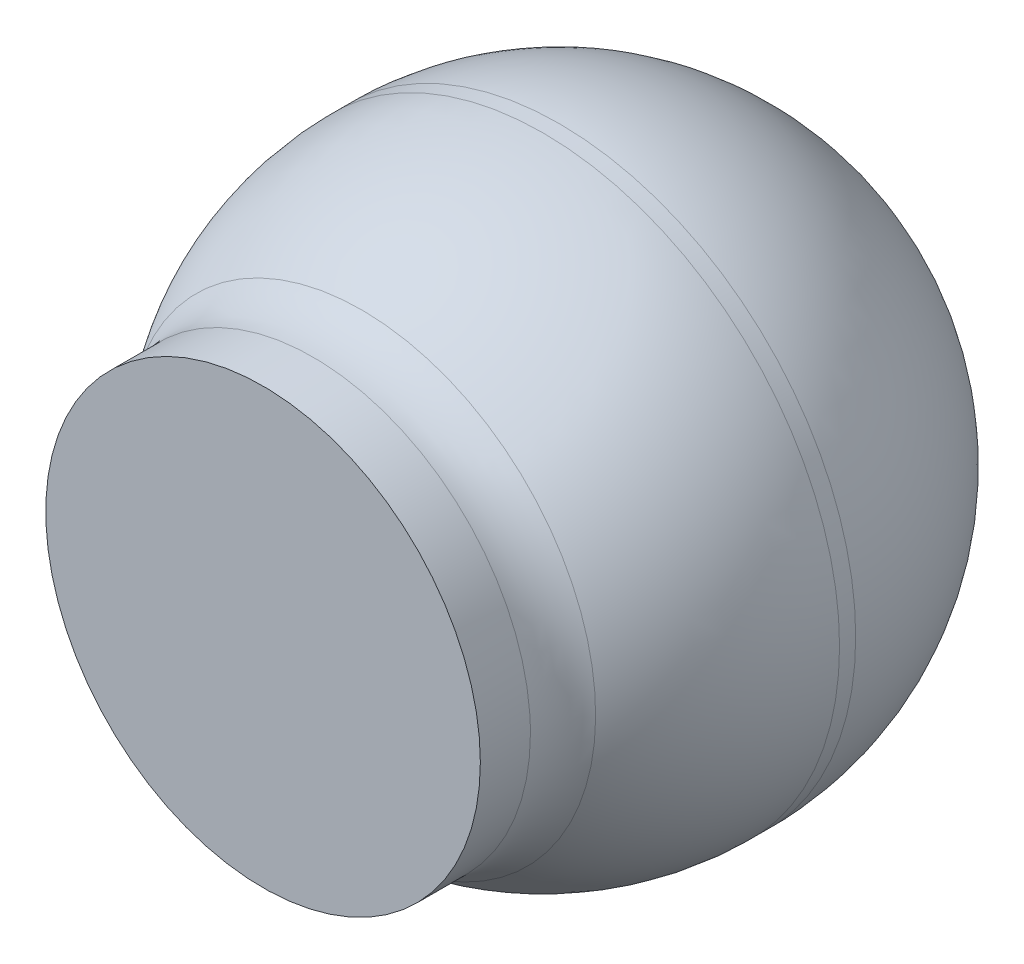
ISO-10303-21;
HEADER;
FILE_DESCRIPTION(('STEP AP214'),'2;1');
FILE_NAME('part.step','',(''),(''),'','','');
FILE_SCHEMA(('AUTOMOTIVE_DESIGN { 1 0 10303 214 1 1 1 1 }'));
ENDSEC;
DATA;
#1=APPLICATION_CONTEXT('core data for automotive mechanical design processes');
#2=APPLICATION_PROTOCOL_DEFINITION('international standard','automotive_design',2000,#1);
#3=PRODUCT_CONTEXT('',#1,'mechanical');
#4=PRODUCT('Part','Part','',(#3));
#5=PRODUCT_RELATED_PRODUCT_CATEGORY('part','',(#4));
#6=PRODUCT_DEFINITION_FORMATION('','',#4);
#7=PRODUCT_DEFINITION_CONTEXT('part definition',#1,'design');
#8=PRODUCT_DEFINITION('design','',#6,#7);
#9=PRODUCT_DEFINITION_SHAPE('','',#8);
#10=(LENGTH_UNIT() NAMED_UNIT(*) SI_UNIT(.MILLI.,.METRE.));
#11=(NAMED_UNIT(*) PLANE_ANGLE_UNIT() SI_UNIT($,.RADIAN.));
#12=(NAMED_UNIT(*) SI_UNIT($,.STERADIAN.) SOLID_ANGLE_UNIT());
#13=UNCERTAINTY_MEASURE_WITH_UNIT(LENGTH_MEASURE(1.E-05),#10,'distance_accuracy_value','');
#14=(GEOMETRIC_REPRESENTATION_CONTEXT(3) GLOBAL_UNCERTAINTY_ASSIGNED_CONTEXT((#13)) GLOBAL_UNIT_ASSIGNED_CONTEXT((#10,
#11,#12)) REPRESENTATION_CONTEXT('',''));
#15=CARTESIAN_POINT('',(0.,0.,0.));
#16=DIRECTION('',(0.,0.,1.));
#17=DIRECTION('',(1.,0.,0.));
#18=AXIS2_PLACEMENT_3D('',#15,#16,#17);
#19=CARTESIAN_POINT('',(-4.372919922269,-2.781349291452,10.006534503384));
#20=DIRECTION('',(0.,0.,-1.));
#21=DIRECTION('',(-1.,0.,0.));
#22=AXIS2_PLACEMENT_3D('',#19,#20,#21);
#23=PLANE('',#22);
#24=CARTESIAN_POINT('',(-4.372919922269,-2.781349291452,10.006534503384));
#25=DIRECTION('',(0.,0.,1.));
#26=DIRECTION('',(1.,0.,0.));
#27=AXIS2_PLACEMENT_3D('',#24,#25,#26);
#28=CIRCLE('',#27,0.275);
#29=CARTESIAN_POINT('',(-4.097919922269,-2.781349291452,10.006534503384));
#30=VERTEX_POINT('',#29);
#31=EDGE_CURVE('E20',#30,#30,#28,.F.);
#32=ORIENTED_EDGE('',*,*,#31,.F.);
#33=EDGE_LOOP('',(#32));
#34=FACE_BOUND('',#33,.T.);
#35=ADVANCED_FACE('F17',(#34),#23,.F.);
#36=CARTESIAN_POINT('',(-4.372919922269,-2.781349291452,9.906534503384));
#37=DIRECTION('',(0.,0.,1.));
#38=DIRECTION('',(1.,0.,0.));
#39=AXIS2_PLACEMENT_3D('',#36,#37,#38);
#40=CYLINDRICAL_SURFACE('',#39,0.275);
#41=CARTESIAN_POINT('',(-4.372919922269,-2.781349291452,9.943180457728));
#42=DIRECTION('',(0.,0.,-1.));
#43=DIRECTION('',(0.996700902337582,0.0811622527992454,0.));
#44=AXIS2_PLACEMENT_3D('',#41,#42,#43);
#45=CIRCLE('',#44,0.275);
#46=CARTESIAN_POINT('',(-4.09882717412617,-2.75902967193221,9.943180457728));
#47=VERTEX_POINT('',#46);
#48=EDGE_CURVE('E65',#47,#47,#45,.F.);
#49=ORIENTED_EDGE('',*,*,#48,.T.);
#50=EDGE_LOOP('',(#49));
#51=FACE_BOUND('',#50,.T.);
#52=ORIENTED_EDGE('',*,*,#31,.T.);
#53=EDGE_LOOP('',(#52));
#54=FACE_BOUND('',#53,.T.);
#55=ADVANCED_FACE('F62',(#51,#54),#40,.T.);
#56=CARTESIAN_POINT('',(-4.372919922269,-2.781349291452,9.943180457728));
#57=DIRECTION('',(0.,0.,-1.));
#58=DIRECTION('',(0.996700902337583,0.081162252799246,0.));
#59=AXIS2_PLACEMENT_3D('',#56,#57,#58);
#60=TOROIDAL_SURFACE('',#59,0.375,0.1);
#61=ORIENTED_EDGE('',*,*,#48,.F.);
#62=EDGE_LOOP('',(#61));
#63=FACE_BOUND('',#62,.T.);
#64=CARTESIAN_POINT('',(-4.372919922269,-2.781349291452,9.881744931236));
#65=DIRECTION('',(0.,0.,-1.));
#66=DIRECTION('',(-0.996700902337598,-0.0811622527990608,0.));
#67=AXIS2_PLACEMENT_3D('',#64,#65,#66);
#68=CIRCLE('',#67,0.296097046412665);
#69=CARTESIAN_POINT('',(-4.668040115608,-2.805381194786,9.881744931236));
#70=VERTEX_POINT('',#69);
#71=EDGE_CURVE('E39',#70,#70,#68,.T.);
#72=ORIENTED_EDGE('',*,*,#71,.F.);
#73=EDGE_LOOP('',(#72));
#74=FACE_BOUND('',#73,.T.);
#75=ADVANCED_FACE('F57',(#63,#74),#60,.F.);
#76=CARTESIAN_POINT('',(-4.746682760645,-2.811785136252,9.651976062157));
#77=CARTESIAN_POINT('',(-4.746682760645,-2.811785136252,9.701461392103));
#78=CARTESIAN_POINT('',(-4.738526217348,-2.811120941579,9.750947004335));
#79=CARTESIAN_POINT('',(-4.722207085349,-2.809792059952,9.798626332798));
#80=CARTESIAN_POINT('',(-4.698341390838,-2.807848654938,9.842699544317));
#81=CARTESIAN_POINT('',(-4.668040115608,-2.805381194786,9.881744931236));
#82=(BOUNDED_CURVE() B_SPLINE_CURVE(5,(#76,#77,#78,#79,#80,#81),.UNSPECIFIED.,.F.,
.F.) B_SPLINE_CURVE_WITH_KNOTS((6,6),(0.,0.661568582165),
.UNSPECIFIED.) CURVE() GEOMETRIC_REPRESENTATION_ITEM() RATIONAL_B_SPLINE_CURVE((1.,1.,1.,1.,1.,1.)) REPRESENTATION_ITEM(''));
#83=CARTESIAN_POINT('',(-4.372919922269,-2.781349291452,9.651976062157));
#84=DIRECTION('',(0.,0.,-1.));
#85=AXIS1_PLACEMENT('',#83,#84);
#86=SURFACE_OF_REVOLUTION('',#82,#85);
#87=CARTESIAN_POINT('',(-4.372919922269,-2.781349291452,9.651976062157));
#88=DIRECTION('',(0.,0.,1.));
#89=DIRECTION('',(1.,0.,0.));
#90=AXIS2_PLACEMENT_3D('',#87,#88,#89);
#91=CIRCLE('',#90,0.375);
#92=CARTESIAN_POINT('',(-3.997919922269,-2.781349291452,9.651976062157));
#93=VERTEX_POINT('',#92);
#94=EDGE_CURVE('E36',#93,#93,#91,.F.);
#95=ORIENTED_EDGE('',*,*,#94,.F.);
#96=EDGE_LOOP('',(#95));
#97=FACE_BOUND('',#96,.T.);
#98=ORIENTED_EDGE('',*,*,#71,.T.);
#99=EDGE_LOOP('',(#98));
#100=FACE_BOUND('',#99,.T.);
#101=ADVANCED_FACE('F53',(#97,#100),#86,.F.);
#102=CARTESIAN_POINT('',(-4.372919922269,-2.781349291452,9.256534503384));
#103=DIRECTION('',(0.,0.,1.));
#104=DIRECTION('',(1.,0.,0.));
#105=AXIS2_PLACEMENT_3D('',#102,#103,#104);
#106=CYLINDRICAL_SURFACE('',#105,0.375);
#107=CARTESIAN_POINT('',(-4.372919922269,-2.781349291452,9.631534503384));
#108=DIRECTION('',(0.,0.,-1.));
#109=DIRECTION('',(0.0811622527992356,-0.996700902337583,0.));
#110=AXIS2_PLACEMENT_3D('',#107,#108,#109);
#111=CIRCLE('',#110,0.375);
#112=CARTESIAN_POINT('',(-4.34248407746929,-3.15511212982859,9.631534503384));
#113=VERTEX_POINT('',#112);
#114=CARTESIAN_POINT('',(-4.40335576706871,-2.40758645307541,9.631534503384));
#115=VERTEX_POINT('',#114);
#116=EDGE_CURVE('E11',#113,#115,#111,.T.);
#117=ORIENTED_EDGE('',*,*,#116,.F.);
#118=CARTESIAN_POINT('',(-4.372919922269,-2.781349291452,9.631534503384));
#119=DIRECTION('',(3.33436315446763E-12,2.72100352061447E-13,1.));
#120=DIRECTION('',(0.0811622527992366,-0.996700902337583,0.));
#121=AXIS2_PLACEMENT_3D('',#118,#119,#120);
#122=CIRCLE('',#121,0.375);
#123=EDGE_CURVE('E25',#115,#113,#122,.F.);
#124=ORIENTED_EDGE('',*,*,#123,.F.);
#125=EDGE_LOOP('',(#117,#124));
#126=FACE_BOUND('',#125,.T.);
#127=ORIENTED_EDGE('',*,*,#94,.T.);
#128=EDGE_LOOP('',(#127));
#129=FACE_BOUND('',#128,.T.);
#130=ADVANCED_FACE('F34',(#126,#129),#106,.T.);
#131=CARTESIAN_POINT('',(-4.372919922269,-2.781349291452,9.631534503384));
#132=DIRECTION('',(0.0811622527992361,-0.996700902337583,0.));
#133=DIRECTION('',(-0.996700902337583,-0.0811622527992361,0.));
#134=AXIS2_PLACEMENT_3D('',#131,#132,#133);
#135=SPHERICAL_SURFACE('',#134,0.375);
#136=ORIENTED_EDGE('',*,*,#123,.T.);
#137=ORIENTED_EDGE('',*,*,#116,.T.);
#138=EDGE_LOOP('',(#136,#137));
#139=FACE_BOUND('',#138,.T.);
#140=ADVANCED_FACE('F32',(#139),#135,.T.);
#141=CLOSED_SHELL('',(#35,#55,#75,#101,#130,#140));
#142=MANIFOLD_SOLID_BREP('B1',#141);
#143=ADVANCED_BREP_SHAPE_REPRESENTATION('',(#18,#142),#14);
#144=SHAPE_DEFINITION_REPRESENTATION(#9,#143);
ENDSEC;
END-ISO-10303-21;
